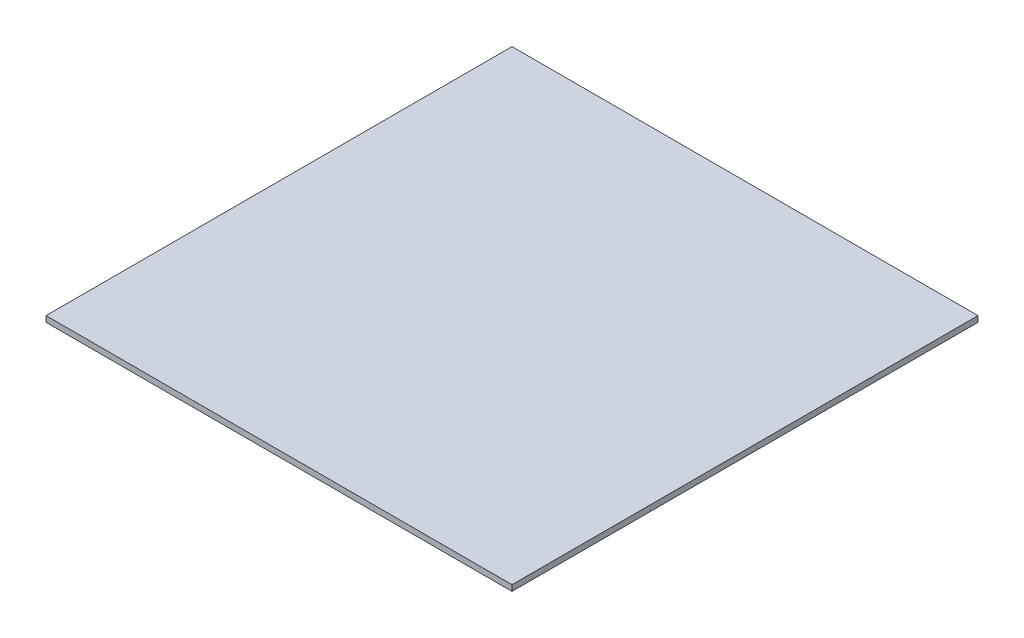
ISO-10303-21;
HEADER;
FILE_DESCRIPTION(('STEP AP214'),'2;1');
FILE_NAME('part.step','',(''),(''),'','','');
FILE_SCHEMA(('AUTOMOTIVE_DESIGN { 1 0 10303 214 1 1 1 1 }'));
ENDSEC;
DATA;
#1=APPLICATION_CONTEXT('core data for automotive mechanical design processes');
#2=APPLICATION_PROTOCOL_DEFINITION('international standard','automotive_design',2000,#1);
#3=PRODUCT_CONTEXT('',#1,'mechanical');
#4=PRODUCT('Part','Part','',(#3));
#5=PRODUCT_RELATED_PRODUCT_CATEGORY('part','',(#4));
#6=PRODUCT_DEFINITION_FORMATION('','',#4);
#7=PRODUCT_DEFINITION_CONTEXT('part definition',#1,'design');
#8=PRODUCT_DEFINITION('design','',#6,#7);
#9=PRODUCT_DEFINITION_SHAPE('','',#8);
#10=(LENGTH_UNIT() NAMED_UNIT(*) SI_UNIT(.MILLI.,.METRE.));
#11=(NAMED_UNIT(*) PLANE_ANGLE_UNIT() SI_UNIT($,.RADIAN.));
#12=(NAMED_UNIT(*) SI_UNIT($,.STERADIAN.) SOLID_ANGLE_UNIT());
#13=UNCERTAINTY_MEASURE_WITH_UNIT(LENGTH_MEASURE(1.E-05),#10,'distance_accuracy_value','');
#14=(GEOMETRIC_REPRESENTATION_CONTEXT(3) GLOBAL_UNCERTAINTY_ASSIGNED_CONTEXT((#13)) GLOBAL_UNIT_ASSIGNED_CONTEXT((#10,
#11,#12)) REPRESENTATION_CONTEXT('',''));
#15=CARTESIAN_POINT('',(0.,0.,0.));
#16=DIRECTION('',(0.,0.,1.));
#17=DIRECTION('',(1.,0.,0.));
#18=AXIS2_PLACEMENT_3D('',#15,#16,#17);
#19=CARTESIAN_POINT('',(-306.280772572206,10.,-448.185352771478));
#20=DIRECTION('',(1.,0.,0.));
#21=DIRECTION('',(0.,0.,-1.));
#22=AXIS2_PLACEMENT_3D('',#19,#20,#21);
#23=PLANE('',#22);
#24=DIRECTION('',(0.,0.,1.));
#25=VECTOR('',#24,1.);
#26=CARTESIAN_POINT('',(-306.280772572206,0.,-448.185352771478));
#27=LINE('',#26,#25);
#28=CARTESIAN_POINT('',(-306.280772572206,0.,-448.185352771478));
#29=VERTEX_POINT('',#28);
#30=CARTESIAN_POINT('',(-306.280772572206,0.,351.814647228522));
#31=VERTEX_POINT('',#30);
#32=EDGE_CURVE('E107',#29,#31,#27,.T.);
#33=ORIENTED_EDGE('',*,*,#32,.T.);
#34=DIRECTION('',(0.,-1.,0.));
#35=VECTOR('',#34,1.);
#36=CARTESIAN_POINT('',(-306.280772572206,10.,351.814647228522));
#37=LINE('',#36,#35);
#38=CARTESIAN_POINT('',(-306.280772572206,10.,351.814647228522));
#39=VERTEX_POINT('',#38);
#40=EDGE_CURVE('E11',#39,#31,#37,.T.);
#41=ORIENTED_EDGE('',*,*,#40,.F.);
#42=DIRECTION('',(0.,0.,1.));
#43=VECTOR('',#42,1.);
#44=CARTESIAN_POINT('',(-306.280772572206,10.,-448.185352771478));
#45=LINE('',#44,#43);
#46=CARTESIAN_POINT('',(-306.280772572206,10.,-448.185352771478));
#47=VERTEX_POINT('',#46);
#48=EDGE_CURVE('E91',#47,#39,#45,.T.);
#49=ORIENTED_EDGE('',*,*,#48,.F.);
#50=DIRECTION('',(0.,-1.,0.));
#51=VECTOR('',#50,1.);
#52=CARTESIAN_POINT('',(-306.280772572206,10.,-448.185352771478));
#53=LINE('',#52,#51);
#54=EDGE_CURVE('E103',#47,#29,#53,.T.);
#55=ORIENTED_EDGE('',*,*,#54,.T.);
#56=EDGE_LOOP('',(#33,#41,#49,#55));
#57=FACE_BOUND('',#56,.T.);
#58=ADVANCED_FACE('F39',(#57),#23,.F.);
#59=CARTESIAN_POINT('',(-306.280772572206,10.,351.814647228522));
#60=DIRECTION('',(0.,0.,-1.));
#61=DIRECTION('',(-1.,0.,0.));
#62=AXIS2_PLACEMENT_3D('',#59,#60,#61);
#63=PLANE('',#62);
#64=DIRECTION('',(1.,0.,0.));
#65=VECTOR('',#64,1.);
#66=CARTESIAN_POINT('',(-306.280772572206,0.,351.814647228522));
#67=LINE('',#66,#65);
#68=CARTESIAN_POINT('',(493.719227427794,0.,351.814647228522));
#69=VERTEX_POINT('',#68);
#70=EDGE_CURVE('E96',#31,#69,#67,.T.);
#71=ORIENTED_EDGE('',*,*,#70,.T.);
#72=DIRECTION('',(0.,-1.,0.));
#73=VECTOR('',#72,1.);
#74=CARTESIAN_POINT('',(493.719227427794,10.,351.814647228522));
#75=LINE('',#74,#73);
#76=CARTESIAN_POINT('',(493.719227427794,10.,351.814647228522));
#77=VERTEX_POINT('',#76);
#78=EDGE_CURVE('E48',#77,#69,#75,.T.);
#79=ORIENTED_EDGE('',*,*,#78,.F.);
#80=DIRECTION('',(1.,0.,0.));
#81=VECTOR('',#80,1.);
#82=CARTESIAN_POINT('',(-306.280772572206,10.,351.814647228522));
#83=LINE('',#82,#81);
#84=EDGE_CURVE('E86',#39,#77,#83,.T.);
#85=ORIENTED_EDGE('',*,*,#84,.F.);
#86=ORIENTED_EDGE('',*,*,#40,.T.);
#87=EDGE_LOOP('',(#71,#79,#85,#86));
#88=FACE_BOUND('',#87,.T.);
#89=ADVANCED_FACE('F95',(#88),#63,.F.);
#90=CARTESIAN_POINT('',(493.719227427794,10.,-448.185352771478));
#91=DIRECTION('',(-1.,0.,0.));
#92=DIRECTION('',(0.,0.,1.));
#93=AXIS2_PLACEMENT_3D('',#90,#91,#92);
#94=PLANE('',#93);
#95=DIRECTION('',(0.,0.,-1.));
#96=VECTOR('',#95,1.);
#97=CARTESIAN_POINT('',(493.719227427794,0.,-448.185352771478));
#98=LINE('',#97,#96);
#99=CARTESIAN_POINT('',(493.719227427794,0.,-448.185352771478));
#100=VERTEX_POINT('',#99);
#101=EDGE_CURVE('E73',#69,#100,#98,.T.);
#102=ORIENTED_EDGE('',*,*,#101,.T.);
#103=DIRECTION('',(0.,-1.,0.));
#104=VECTOR('',#103,1.);
#105=CARTESIAN_POINT('',(493.719227427794,10.,-448.185352771478));
#106=LINE('',#105,#104);
#107=CARTESIAN_POINT('',(493.719227427794,10.,-448.185352771478));
#108=VERTEX_POINT('',#107);
#109=EDGE_CURVE('E98',#108,#100,#106,.T.);
#110=ORIENTED_EDGE('',*,*,#109,.F.);
#111=DIRECTION('',(0.,0.,-1.));
#112=VECTOR('',#111,1.);
#113=CARTESIAN_POINT('',(493.719227427794,10.,-448.185352771478));
#114=LINE('',#113,#112);
#115=EDGE_CURVE('E89',#77,#108,#114,.T.);
#116=ORIENTED_EDGE('',*,*,#115,.F.);
#117=ORIENTED_EDGE('',*,*,#78,.T.);
#118=EDGE_LOOP('',(#102,#110,#116,#117));
#119=FACE_BOUND('',#118,.T.);
#120=ADVANCED_FACE('F99',(#119),#94,.F.);
#121=CARTESIAN_POINT('',(-306.280772572206,10.,-448.185352771478));
#122=DIRECTION('',(0.,0.,1.));
#123=DIRECTION('',(1.,0.,0.));
#124=AXIS2_PLACEMENT_3D('',#121,#122,#123);
#125=PLANE('',#124);
#126=DIRECTION('',(-1.,0.,0.));
#127=VECTOR('',#126,1.);
#128=CARTESIAN_POINT('',(-306.280772572206,0.,-448.185352771478));
#129=LINE('',#128,#127);
#130=EDGE_CURVE('E79',#100,#29,#129,.T.);
#131=ORIENTED_EDGE('',*,*,#130,.T.);
#132=ORIENTED_EDGE('',*,*,#54,.F.);
#133=DIRECTION('',(-1.,0.,0.));
#134=VECTOR('',#133,1.);
#135=CARTESIAN_POINT('',(-306.280772572206,10.,-448.185352771478));
#136=LINE('',#135,#134);
#137=EDGE_CURVE('E56',#108,#47,#136,.T.);
#138=ORIENTED_EDGE('',*,*,#137,.F.);
#139=ORIENTED_EDGE('',*,*,#109,.T.);
#140=EDGE_LOOP('',(#131,#132,#138,#139));
#141=FACE_BOUND('',#140,.T.);
#142=ADVANCED_FACE('F120',(#141),#125,.F.);
#143=CARTESIAN_POINT('',(0.,10.,0.));
#144=DIRECTION('',(0.,1.,0.));
#145=DIRECTION('',(0.,0.,1.));
#146=AXIS2_PLACEMENT_3D('',#143,#144,#145);
#147=PLANE('',#146);
#148=ORIENTED_EDGE('',*,*,#48,.T.);
#149=ORIENTED_EDGE('',*,*,#84,.T.);
#150=ORIENTED_EDGE('',*,*,#115,.T.);
#151=ORIENTED_EDGE('',*,*,#137,.T.);
#152=EDGE_LOOP('',(#148,#149,#150,#151));
#153=FACE_BOUND('',#152,.T.);
#154=ADVANCED_FACE('F87',(#153),#147,.T.);
#155=CARTESIAN_POINT('',(0.,0.,0.));
#156=DIRECTION('',(0.,1.,0.));
#157=DIRECTION('',(0.,0.,1.));
#158=AXIS2_PLACEMENT_3D('',#155,#156,#157);
#159=PLANE('',#158);
#160=ORIENTED_EDGE('',*,*,#32,.F.);
#161=ORIENTED_EDGE('',*,*,#130,.F.);
#162=ORIENTED_EDGE('',*,*,#101,.F.);
#163=ORIENTED_EDGE('',*,*,#70,.F.);
#164=EDGE_LOOP('',(#160,#161,#162,#163));
#165=FACE_BOUND('',#164,.T.);
#166=ADVANCED_FACE('F123',(#165),#159,.F.);
#167=CLOSED_SHELL('',(#58,#89,#120,#142,#154,#166));
#168=MANIFOLD_SOLID_BREP('B2',#167);
#169=ADVANCED_BREP_SHAPE_REPRESENTATION('',(#18,#168),#14);
#170=SHAPE_DEFINITION_REPRESENTATION(#9,#169);
ENDSEC;
END-ISO-10303-21;
